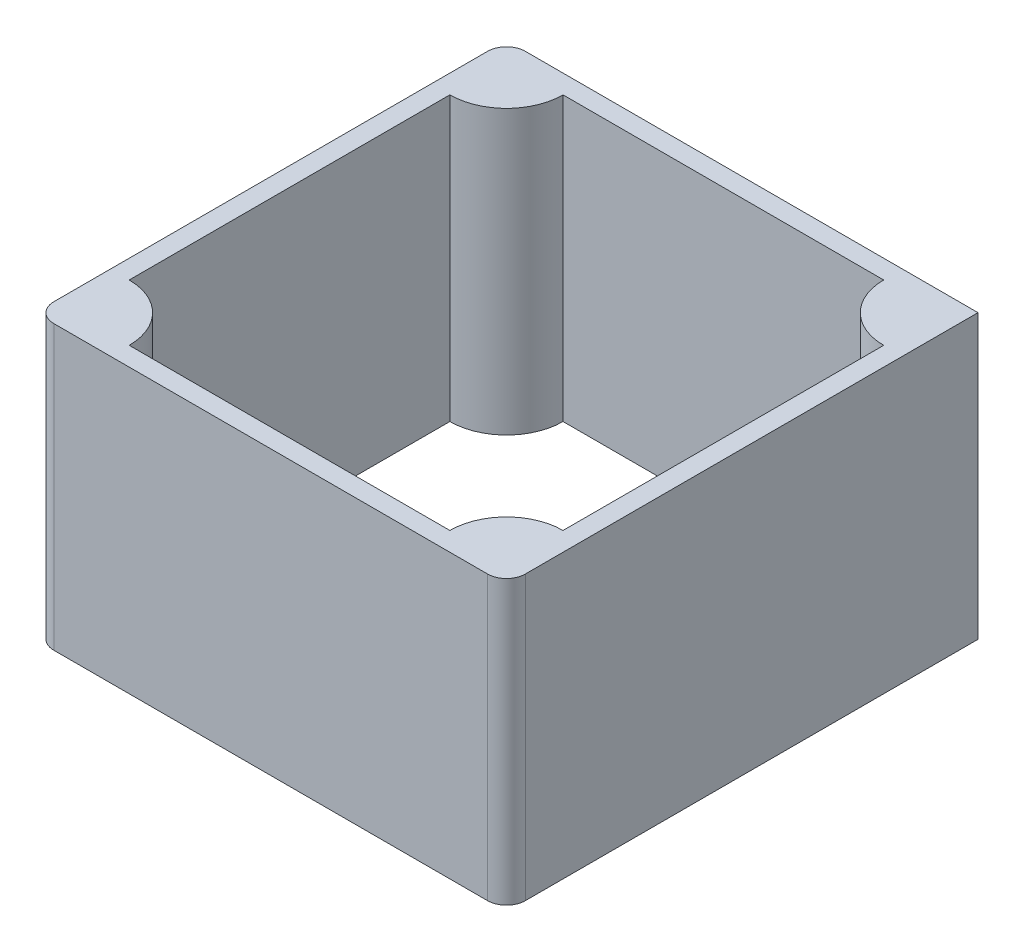
ISO-10303-21;
HEADER;
FILE_DESCRIPTION(('STEP AP214'),'2;1');
FILE_NAME('part.step','',(''),(''),'','','');
FILE_SCHEMA(('AUTOMOTIVE_DESIGN { 1 0 10303 214 1 1 1 1 }'));
ENDSEC;
DATA;
#1=APPLICATION_CONTEXT('core data for automotive mechanical design processes');
#2=APPLICATION_PROTOCOL_DEFINITION('international standard','automotive_design',2000,#1);
#3=PRODUCT_CONTEXT('',#1,'mechanical');
#4=PRODUCT('Part','Part','',(#3));
#5=PRODUCT_RELATED_PRODUCT_CATEGORY('part','',(#4));
#6=PRODUCT_DEFINITION_FORMATION('','',#4);
#7=PRODUCT_DEFINITION_CONTEXT('part definition',#1,'design');
#8=PRODUCT_DEFINITION('design','',#6,#7);
#9=PRODUCT_DEFINITION_SHAPE('','',#8);
#10=(LENGTH_UNIT() NAMED_UNIT(*) SI_UNIT(.MILLI.,.METRE.));
#11=(NAMED_UNIT(*) PLANE_ANGLE_UNIT() SI_UNIT($,.RADIAN.));
#12=(NAMED_UNIT(*) SI_UNIT($,.STERADIAN.) SOLID_ANGLE_UNIT());
#13=UNCERTAINTY_MEASURE_WITH_UNIT(LENGTH_MEASURE(1.E-05),#10,'distance_accuracy_value','');
#14=(GEOMETRIC_REPRESENTATION_CONTEXT(3) GLOBAL_UNCERTAINTY_ASSIGNED_CONTEXT((#13)) GLOBAL_UNIT_ASSIGNED_CONTEXT((#10,
#11,#12)) REPRESENTATION_CONTEXT('',''));
#15=CARTESIAN_POINT('',(0.,0.,0.));
#16=DIRECTION('',(0.,0.,1.));
#17=DIRECTION('',(1.,0.,0.));
#18=AXIS2_PLACEMENT_3D('',#15,#16,#17);
#19=CARTESIAN_POINT('',(0.,30.,0.));
#20=DIRECTION('',(0.,1.,0.));
#21=DIRECTION('',(0.,0.,1.));
#22=AXIS2_PLACEMENT_3D('',#19,#20,#21);
#23=PLANE('',#22);
#24=DIRECTION('',(-1.,0.,0.));
#25=VECTOR('',#24,1.);
#26=CARTESIAN_POINT('',(-11.2954846734203,30.,-9.66227881155136));
#27=LINE('',#26,#25);
#28=CARTESIAN_POINT('',(38.7045153265797,30.,-9.66227881155136));
#29=VERTEX_POINT('',#28);
#30=CARTESIAN_POINT('',(-9.29548467342035,30.,-9.66227881155136));
#31=VERTEX_POINT('',#30);
#32=EDGE_CURVE('E218',#29,#31,#27,.T.);
#33=ORIENTED_EDGE('',*,*,#32,.T.);
#34=CARTESIAN_POINT('',(-9.29548467342035,30.,-7.66227881155136));
#35=DIRECTION('',(0.,1.,0.));
#36=DIRECTION('',(0.,0.,1.));
#37=AXIS2_PLACEMENT_3D('',#34,#35,#36);
#38=CIRCLE('',#37,2.);
#39=CARTESIAN_POINT('',(-11.2954846734203,30.,-7.66227881155136));
#40=VERTEX_POINT('',#39);
#41=EDGE_CURVE('E248',#31,#40,#38,.T.);
#42=ORIENTED_EDGE('',*,*,#41,.T.);
#43=DIRECTION('',(0.,0.,1.));
#44=VECTOR('',#43,1.);
#45=CARTESIAN_POINT('',(-11.2954846734203,30.,-9.66227881155136));
#46=LINE('',#45,#44);
#47=CARTESIAN_POINT('',(-11.2954846734203,30.,38.3377211884486));
#48=VERTEX_POINT('',#47);
#49=EDGE_CURVE('E210',#40,#48,#46,.T.);
#50=ORIENTED_EDGE('',*,*,#49,.T.);
#51=CARTESIAN_POINT('',(-9.29548467342034,30.,38.3377211884486));
#52=DIRECTION('',(0.,1.,0.));
#53=DIRECTION('',(0.,0.,1.));
#54=AXIS2_PLACEMENT_3D('',#51,#52,#53);
#55=CIRCLE('',#54,2.);
#56=CARTESIAN_POINT('',(-9.29548467342034,30.,40.3377211884486));
#57=VERTEX_POINT('',#56);
#58=EDGE_CURVE('E245',#48,#57,#55,.T.);
#59=ORIENTED_EDGE('',*,*,#58,.T.);
#60=DIRECTION('',(1.,0.,0.));
#61=VECTOR('',#60,1.);
#62=CARTESIAN_POINT('',(-11.2954846734203,30.,40.3377211884486));
#63=LINE('',#62,#61);
#64=CARTESIAN_POINT('',(36.7045153265797,30.,40.3377211884486));
#65=VERTEX_POINT('',#64);
#66=EDGE_CURVE('E213',#57,#65,#63,.T.);
#67=ORIENTED_EDGE('',*,*,#66,.T.);
#68=CARTESIAN_POINT('',(36.7045153265797,30.,38.3377211884486));
#69=DIRECTION('',(0.,1.,0.));
#70=DIRECTION('',(0.,0.,1.));
#71=AXIS2_PLACEMENT_3D('',#68,#69,#70);
#72=CIRCLE('',#71,2.);
#73=CARTESIAN_POINT('',(38.7045153265797,30.,38.3377211884486));
#74=VERTEX_POINT('',#73);
#75=EDGE_CURVE('E47',#65,#74,#72,.T.);
#76=ORIENTED_EDGE('',*,*,#75,.T.);
#77=DIRECTION('',(0.,0.,-1.));
#78=VECTOR('',#77,1.);
#79=CARTESIAN_POINT('',(38.7045153265797,30.,-9.66227881155136));
#80=LINE('',#79,#78);
#81=EDGE_CURVE('E216',#74,#29,#80,.T.);
#82=ORIENTED_EDGE('',*,*,#81,.T.);
#83=EDGE_LOOP('',(#33,#42,#50,#59,#67,#76,#82));
#84=FACE_BOUND('',#83,.T.);
#85=DIRECTION('',(1.,0.,0.));
#86=VECTOR('',#85,1.);
#87=CARTESIAN_POINT('',(-3.29548467342032,30.,38.3377211884486));
#88=LINE('',#87,#86);
#89=CARTESIAN_POINT('',(-3.29548467342032,30.,38.3377211884486));
#90=VERTEX_POINT('',#89);
#91=CARTESIAN_POINT('',(30.7045153265796,30.,38.3377211884486));
#92=VERTEX_POINT('',#91);
#93=EDGE_CURVE('E150',#90,#92,#88,.T.);
#94=ORIENTED_EDGE('',*,*,#93,.F.);
#95=CARTESIAN_POINT('',(-9.29548467342034,30.,38.3377211884486));
#96=DIRECTION('',(0.,-1.,0.));
#97=DIRECTION('',(0.,0.,1.));
#98=AXIS2_PLACEMENT_3D('',#95,#96,#97);
#99=CIRCLE('',#98,6.00000000000002);
#100=CARTESIAN_POINT('',(-9.29548467342034,30.,32.3377211884486));
#101=VERTEX_POINT('',#100);
#102=EDGE_CURVE('E140',#101,#90,#99,.T.);
#103=ORIENTED_EDGE('',*,*,#102,.F.);
#104=DIRECTION('',(0.,0.,1.));
#105=VECTOR('',#104,1.);
#106=CARTESIAN_POINT('',(-9.29548467342036,30.,-1.66227881155136));
#107=LINE('',#106,#105);
#108=CARTESIAN_POINT('',(-9.29548467342036,30.,-1.66227881155136));
#109=VERTEX_POINT('',#108);
#110=EDGE_CURVE('E176',#109,#101,#107,.T.);
#111=ORIENTED_EDGE('',*,*,#110,.F.);
#112=CARTESIAN_POINT('',(-9.29548467342036,30.,-7.66227881155136));
#113=DIRECTION('',(0.,-1.,0.));
#114=DIRECTION('',(0.,0.,1.));
#115=AXIS2_PLACEMENT_3D('',#112,#113,#114);
#116=CIRCLE('',#115,6.);
#117=CARTESIAN_POINT('',(-3.29548467342036,30.,-7.66227881155136));
#118=VERTEX_POINT('',#117);
#119=EDGE_CURVE('E173',#118,#109,#116,.T.);
#120=ORIENTED_EDGE('',*,*,#119,.F.);
#121=DIRECTION('',(-1.,0.,0.));
#122=VECTOR('',#121,1.);
#123=CARTESIAN_POINT('',(-3.29548467342036,30.,-7.66227881155136));
#124=LINE('',#123,#122);
#125=CARTESIAN_POINT('',(30.7045153265796,30.,-7.66227881155137));
#126=VERTEX_POINT('',#125);
#127=EDGE_CURVE('E171',#126,#118,#124,.T.);
#128=ORIENTED_EDGE('',*,*,#127,.F.);
#129=CARTESIAN_POINT('',(36.7045153265796,30.,-7.66227881155137));
#130=DIRECTION('',(0.,-1.,0.));
#131=DIRECTION('',(0.,0.,1.));
#132=AXIS2_PLACEMENT_3D('',#129,#130,#131);
#133=CIRCLE('',#132,6.);
#134=CARTESIAN_POINT('',(36.7045153265796,30.,-1.66227881155137));
#135=VERTEX_POINT('',#134);
#136=EDGE_CURVE('E169',#135,#126,#133,.T.);
#137=ORIENTED_EDGE('',*,*,#136,.F.);
#138=DIRECTION('',(0.,0.,-1.));
#139=VECTOR('',#138,1.);
#140=CARTESIAN_POINT('',(36.7045153265796,30.,-1.66227881155137));
#141=LINE('',#140,#139);
#142=CARTESIAN_POINT('',(36.7045153265797,30.,32.3377211884486));
#143=VERTEX_POINT('',#142);
#144=EDGE_CURVE('E165',#143,#135,#141,.T.);
#145=ORIENTED_EDGE('',*,*,#144,.F.);
#146=CARTESIAN_POINT('',(36.7045153265797,30.,38.3377211884486));
#147=DIRECTION('',(0.,-1.,0.));
#148=DIRECTION('',(0.,0.,1.));
#149=AXIS2_PLACEMENT_3D('',#146,#147,#148);
#150=CIRCLE('',#149,6.00000000000002);
#151=EDGE_CURVE('E163',#92,#143,#150,.T.);
#152=ORIENTED_EDGE('',*,*,#151,.F.);
#153=EDGE_LOOP('',(#94,#103,#111,#120,#128,#137,#145,#152));
#154=FACE_BOUND('',#153,.T.);
#155=ADVANCED_FACE('F32',(#84,#154),#23,.T.);
#156=CARTESIAN_POINT('',(0.,0.,0.));
#157=DIRECTION('',(0.,1.,0.));
#158=DIRECTION('',(0.,0.,1.));
#159=AXIS2_PLACEMENT_3D('',#156,#157,#158);
#160=PLANE('',#159);
#161=DIRECTION('',(0.,0.,1.));
#162=VECTOR('',#161,1.);
#163=CARTESIAN_POINT('',(-11.2954846734203,0.,-9.66227881155136));
#164=LINE('',#163,#162);
#165=CARTESIAN_POINT('',(-11.2954846734203,0.,-7.66227881155136));
#166=VERTEX_POINT('',#165);
#167=CARTESIAN_POINT('',(-11.2954846734203,0.,38.3377211884486));
#168=VERTEX_POINT('',#167);
#169=EDGE_CURVE('E158',#166,#168,#164,.T.);
#170=ORIENTED_EDGE('',*,*,#169,.F.);
#171=CARTESIAN_POINT('',(-9.29548467342035,0.,-7.66227881155136));
#172=DIRECTION('',(0.,1.,0.));
#173=DIRECTION('',(0.,0.,1.));
#174=AXIS2_PLACEMENT_3D('',#171,#172,#173);
#175=CIRCLE('',#174,2.);
#176=CARTESIAN_POINT('',(-9.29548467342035,0.,-9.66227881155136));
#177=VERTEX_POINT('',#176);
#178=EDGE_CURVE('E241',#166,#177,#175,.F.);
#179=ORIENTED_EDGE('',*,*,#178,.T.);
#180=DIRECTION('',(-1.,0.,0.));
#181=VECTOR('',#180,1.);
#182=CARTESIAN_POINT('',(-11.2954846734203,0.,-9.66227881155136));
#183=LINE('',#182,#181);
#184=CARTESIAN_POINT('',(38.7045153265797,0.,-9.66227881155136));
#185=VERTEX_POINT('',#184);
#186=EDGE_CURVE('E214',#185,#177,#183,.T.);
#187=ORIENTED_EDGE('',*,*,#186,.F.);
#188=DIRECTION('',(0.,0.,-1.));
#189=VECTOR('',#188,1.);
#190=CARTESIAN_POINT('',(38.7045153265797,0.,-9.66227881155136));
#191=LINE('',#190,#189);
#192=CARTESIAN_POINT('',(38.7045153265797,0.,38.3377211884486));
#193=VERTEX_POINT('',#192);
#194=EDGE_CURVE('E226',#193,#185,#191,.T.);
#195=ORIENTED_EDGE('',*,*,#194,.F.);
#196=CARTESIAN_POINT('',(36.7045153265797,0.,38.3377211884486));
#197=DIRECTION('',(0.,1.,0.));
#198=DIRECTION('',(0.,0.,1.));
#199=AXIS2_PLACEMENT_3D('',#196,#197,#198);
#200=CIRCLE('',#199,2.);
#201=CARTESIAN_POINT('',(36.7045153265797,0.,40.3377211884486));
#202=VERTEX_POINT('',#201);
#203=EDGE_CURVE('E239',#193,#202,#200,.F.);
#204=ORIENTED_EDGE('',*,*,#203,.T.);
#205=DIRECTION('',(1.,0.,0.));
#206=VECTOR('',#205,1.);
#207=CARTESIAN_POINT('',(-11.2954846734203,0.,40.3377211884486));
#208=LINE('',#207,#206);
#209=CARTESIAN_POINT('',(-9.29548467342034,0.,40.3377211884486));
#210=VERTEX_POINT('',#209);
#211=EDGE_CURVE('E224',#210,#202,#208,.T.);
#212=ORIENTED_EDGE('',*,*,#211,.F.);
#213=CARTESIAN_POINT('',(-9.29548467342034,0.,38.3377211884486));
#214=DIRECTION('',(0.,1.,0.));
#215=DIRECTION('',(0.,0.,1.));
#216=AXIS2_PLACEMENT_3D('',#213,#214,#215);
#217=CIRCLE('',#216,2.);
#218=EDGE_CURVE('E237',#210,#168,#217,.F.);
#219=ORIENTED_EDGE('',*,*,#218,.T.);
#220=EDGE_LOOP('',(#170,#179,#187,#195,#204,#212,#219));
#221=FACE_BOUND('',#220,.T.);
#222=CARTESIAN_POINT('',(-9.29548467342034,0.,38.3377211884486));
#223=DIRECTION('',(0.,-1.,0.));
#224=DIRECTION('',(0.,0.,1.));
#225=AXIS2_PLACEMENT_3D('',#222,#223,#224);
#226=CIRCLE('',#225,6.00000000000002);
#227=CARTESIAN_POINT('',(-9.29548467342034,0.,32.3377211884486));
#228=VERTEX_POINT('',#227);
#229=CARTESIAN_POINT('',(-3.29548467342032,0.,38.3377211884486));
#230=VERTEX_POINT('',#229);
#231=EDGE_CURVE('E178',#228,#230,#226,.T.);
#232=ORIENTED_EDGE('',*,*,#231,.T.);
#233=DIRECTION('',(1.,0.,0.));
#234=VECTOR('',#233,1.);
#235=CARTESIAN_POINT('',(-3.29548467342032,0.,38.3377211884486));
#236=LINE('',#235,#234);
#237=CARTESIAN_POINT('',(30.7045153265796,0.,38.3377211884486));
#238=VERTEX_POINT('',#237);
#239=EDGE_CURVE('E157',#230,#238,#236,.T.);
#240=ORIENTED_EDGE('',*,*,#239,.T.);
#241=CARTESIAN_POINT('',(36.7045153265797,0.,38.3377211884486));
#242=DIRECTION('',(0.,-1.,0.));
#243=DIRECTION('',(0.,0.,1.));
#244=AXIS2_PLACEMENT_3D('',#241,#242,#243);
#245=CIRCLE('',#244,6.00000000000002);
#246=CARTESIAN_POINT('',(36.7045153265797,0.,32.3377211884486));
#247=VERTEX_POINT('',#246);
#248=EDGE_CURVE('E181',#238,#247,#245,.T.);
#249=ORIENTED_EDGE('',*,*,#248,.T.);
#250=DIRECTION('',(0.,0.,-1.));
#251=VECTOR('',#250,1.);
#252=CARTESIAN_POINT('',(36.7045153265796,0.,-1.66227881155137));
#253=LINE('',#252,#251);
#254=CARTESIAN_POINT('',(36.7045153265796,0.,-1.66227881155137));
#255=VERTEX_POINT('',#254);
#256=EDGE_CURVE('E184',#247,#255,#253,.T.);
#257=ORIENTED_EDGE('',*,*,#256,.T.);
#258=CARTESIAN_POINT('',(36.7045153265796,0.,-7.66227881155137));
#259=DIRECTION('',(0.,-1.,0.));
#260=DIRECTION('',(0.,0.,1.));
#261=AXIS2_PLACEMENT_3D('',#258,#259,#260);
#262=CIRCLE('',#261,6.);
#263=CARTESIAN_POINT('',(30.7045153265796,0.,-7.66227881155137));
#264=VERTEX_POINT('',#263);
#265=EDGE_CURVE('E187',#255,#264,#262,.T.);
#266=ORIENTED_EDGE('',*,*,#265,.T.);
#267=DIRECTION('',(-1.,0.,0.));
#268=VECTOR('',#267,1.);
#269=CARTESIAN_POINT('',(-3.29548467342036,0.,-7.66227881155136));
#270=LINE('',#269,#268);
#271=CARTESIAN_POINT('',(-3.29548467342036,0.,-7.66227881155136));
#272=VERTEX_POINT('',#271);
#273=EDGE_CURVE('E190',#264,#272,#270,.T.);
#274=ORIENTED_EDGE('',*,*,#273,.T.);
#275=CARTESIAN_POINT('',(-9.29548467342036,0.,-7.66227881155136));
#276=DIRECTION('',(0.,-1.,0.));
#277=DIRECTION('',(0.,0.,1.));
#278=AXIS2_PLACEMENT_3D('',#275,#276,#277);
#279=CIRCLE('',#278,6.);
#280=CARTESIAN_POINT('',(-9.29548467342036,0.,-1.66227881155136));
#281=VERTEX_POINT('',#280);
#282=EDGE_CURVE('E193',#272,#281,#279,.T.);
#283=ORIENTED_EDGE('',*,*,#282,.T.);
#284=DIRECTION('',(0.,0.,1.));
#285=VECTOR('',#284,1.);
#286=CARTESIAN_POINT('',(-9.29548467342036,0.,-1.66227881155136));
#287=LINE('',#286,#285);
#288=EDGE_CURVE('E151',#281,#228,#287,.T.);
#289=ORIENTED_EDGE('',*,*,#288,.T.);
#290=EDGE_LOOP('',(#232,#240,#249,#257,#266,#274,#283,#289));
#291=FACE_BOUND('',#290,.T.);
#292=ADVANCED_FACE('F260',(#221,#291),#160,.F.);
#293=CARTESIAN_POINT('',(-11.2954846734203,30.,-9.66227881155136));
#294=DIRECTION('',(1.,0.,0.));
#295=DIRECTION('',(0.,0.,-1.));
#296=AXIS2_PLACEMENT_3D('',#293,#294,#295);
#297=PLANE('',#296);
#298=ORIENTED_EDGE('',*,*,#49,.F.);
#299=DIRECTION('',(0.,-1.,0.));
#300=VECTOR('',#299,1.);
#301=CARTESIAN_POINT('',(-11.2954846734203,30.,-7.66227881155136));
#302=LINE('',#301,#300);
#303=EDGE_CURVE('E234',#40,#166,#302,.T.);
#304=ORIENTED_EDGE('',*,*,#303,.T.);
#305=ORIENTED_EDGE('',*,*,#169,.T.);
#306=DIRECTION('',(0.,-1.,0.));
#307=VECTOR('',#306,1.);
#308=CARTESIAN_POINT('',(-11.2954846734203,30.,38.3377211884486));
#309=LINE('',#308,#307);
#310=EDGE_CURVE('E232',#168,#48,#309,.F.);
#311=ORIENTED_EDGE('',*,*,#310,.T.);
#312=EDGE_LOOP('',(#298,#304,#305,#311));
#313=FACE_BOUND('',#312,.T.);
#314=ADVANCED_FACE('F279',(#313),#297,.F.);
#315=CARTESIAN_POINT('',(-11.2954846734203,30.,40.3377211884486));
#316=DIRECTION('',(0.,0.,-1.));
#317=DIRECTION('',(-1.,0.,0.));
#318=AXIS2_PLACEMENT_3D('',#315,#316,#317);
#319=PLANE('',#318);
#320=ORIENTED_EDGE('',*,*,#211,.T.);
#321=DIRECTION('',(0.,-1.,0.));
#322=VECTOR('',#321,1.);
#323=CARTESIAN_POINT('',(36.7045153265797,30.,40.3377211884486));
#324=LINE('',#323,#322);
#325=EDGE_CURVE('E11',#202,#65,#324,.F.);
#326=ORIENTED_EDGE('',*,*,#325,.T.);
#327=ORIENTED_EDGE('',*,*,#66,.F.);
#328=DIRECTION('',(0.,-1.,0.));
#329=VECTOR('',#328,1.);
#330=CARTESIAN_POINT('',(-9.29548467342034,30.,40.3377211884486));
#331=LINE('',#330,#329);
#332=EDGE_CURVE('E40',#57,#210,#331,.T.);
#333=ORIENTED_EDGE('',*,*,#332,.T.);
#334=EDGE_LOOP('',(#320,#326,#327,#333));
#335=FACE_BOUND('',#334,.T.);
#336=ADVANCED_FACE('F255',(#335),#319,.F.);
#337=CARTESIAN_POINT('',(38.7045153265797,30.,-9.66227881155136));
#338=DIRECTION('',(-1.,0.,0.));
#339=DIRECTION('',(0.,0.,1.));
#340=AXIS2_PLACEMENT_3D('',#337,#338,#339);
#341=PLANE('',#340);
#342=ORIENTED_EDGE('',*,*,#81,.F.);
#343=DIRECTION('',(0.,-1.,0.));
#344=VECTOR('',#343,1.);
#345=CARTESIAN_POINT('',(38.7045153265797,30.,38.3377211884486));
#346=LINE('',#345,#344);
#347=EDGE_CURVE('E250',#74,#193,#346,.T.);
#348=ORIENTED_EDGE('',*,*,#347,.T.);
#349=ORIENTED_EDGE('',*,*,#194,.T.);
#350=DIRECTION('',(0.,-1.,0.));
#351=VECTOR('',#350,1.);
#352=CARTESIAN_POINT('',(38.7045153265797,30.,-9.66227881155136));
#353=LINE('',#352,#351);
#354=EDGE_CURVE('E221',#29,#185,#353,.T.);
#355=ORIENTED_EDGE('',*,*,#354,.F.);
#356=EDGE_LOOP('',(#342,#348,#349,#355));
#357=FACE_BOUND('',#356,.T.);
#358=ADVANCED_FACE('F268',(#357),#341,.F.);
#359=CARTESIAN_POINT('',(-11.2954846734203,30.,-9.66227881155136));
#360=DIRECTION('',(0.,0.,1.));
#361=DIRECTION('',(1.,0.,0.));
#362=AXIS2_PLACEMENT_3D('',#359,#360,#361);
#363=PLANE('',#362);
#364=ORIENTED_EDGE('',*,*,#186,.T.);
#365=DIRECTION('',(0.,-1.,0.));
#366=VECTOR('',#365,1.);
#367=CARTESIAN_POINT('',(-9.29548467342035,30.,-9.66227881155136));
#368=LINE('',#367,#366);
#369=EDGE_CURVE('E243',#177,#31,#368,.F.);
#370=ORIENTED_EDGE('',*,*,#369,.T.);
#371=ORIENTED_EDGE('',*,*,#32,.F.);
#372=ORIENTED_EDGE('',*,*,#354,.T.);
#373=EDGE_LOOP('',(#364,#370,#371,#372));
#374=FACE_BOUND('',#373,.T.);
#375=ADVANCED_FACE('F281',(#374),#363,.F.);
#376=CARTESIAN_POINT('',(-9.29548467342034,30.,38.3377211884486));
#377=DIRECTION('',(0.,-1.,0.));
#378=DIRECTION('',(0.,0.,-1.));
#379=AXIS2_PLACEMENT_3D('',#376,#377,#378);
#380=CYLINDRICAL_SURFACE('',#379,6.00000000000002);
#381=ORIENTED_EDGE('',*,*,#231,.F.);
#382=DIRECTION('',(0.,-1.,0.));
#383=VECTOR('',#382,1.);
#384=CARTESIAN_POINT('',(-9.29548467342034,30.,32.3377211884486));
#385=LINE('',#384,#383);
#386=EDGE_CURVE('E146',#101,#228,#385,.T.);
#387=ORIENTED_EDGE('',*,*,#386,.F.);
#388=ORIENTED_EDGE('',*,*,#102,.T.);
#389=DIRECTION('',(0.,-1.,0.));
#390=VECTOR('',#389,1.);
#391=CARTESIAN_POINT('',(-3.29548467342032,30.,38.3377211884486));
#392=LINE('',#391,#390);
#393=EDGE_CURVE('E143',#90,#230,#392,.T.);
#394=ORIENTED_EDGE('',*,*,#393,.T.);
#395=EDGE_LOOP('',(#381,#387,#388,#394));
#396=FACE_BOUND('',#395,.T.);
#397=ADVANCED_FACE('F142',(#396),#380,.T.);
#398=CARTESIAN_POINT('',(-3.29548467342032,30.,38.3377211884486));
#399=DIRECTION('',(0.,0.,-1.));
#400=DIRECTION('',(-1.,0.,0.));
#401=AXIS2_PLACEMENT_3D('',#398,#399,#400);
#402=PLANE('',#401);
#403=ORIENTED_EDGE('',*,*,#239,.F.);
#404=ORIENTED_EDGE('',*,*,#393,.F.);
#405=ORIENTED_EDGE('',*,*,#93,.T.);
#406=DIRECTION('',(0.,-1.,0.));
#407=VECTOR('',#406,1.);
#408=CARTESIAN_POINT('',(30.7045153265796,30.,38.3377211884486));
#409=LINE('',#408,#407);
#410=EDGE_CURVE('E159',#92,#238,#409,.T.);
#411=ORIENTED_EDGE('',*,*,#410,.T.);
#412=EDGE_LOOP('',(#403,#404,#405,#411));
#413=FACE_BOUND('',#412,.T.);
#414=ADVANCED_FACE('F154',(#413),#402,.T.);
#415=CARTESIAN_POINT('',(36.7045153265797,30.,38.3377211884486));
#416=DIRECTION('',(0.,-1.,0.));
#417=DIRECTION('',(0.,0.,-1.));
#418=AXIS2_PLACEMENT_3D('',#415,#416,#417);
#419=CYLINDRICAL_SURFACE('',#418,6.00000000000002);
#420=ORIENTED_EDGE('',*,*,#248,.F.);
#421=ORIENTED_EDGE('',*,*,#410,.F.);
#422=ORIENTED_EDGE('',*,*,#151,.T.);
#423=DIRECTION('',(0.,-1.,0.));
#424=VECTOR('',#423,1.);
#425=CARTESIAN_POINT('',(36.7045153265797,30.,32.3377211884486));
#426=LINE('',#425,#424);
#427=EDGE_CURVE('E207',#143,#247,#426,.T.);
#428=ORIENTED_EDGE('',*,*,#427,.T.);
#429=EDGE_LOOP('',(#420,#421,#422,#428));
#430=FACE_BOUND('',#429,.T.);
#431=ADVANCED_FACE('F299',(#430),#419,.T.);
#432=CARTESIAN_POINT('',(36.7045153265796,30.,-1.66227881155137));
#433=DIRECTION('',(-1.,0.,0.));
#434=DIRECTION('',(0.,0.,1.));
#435=AXIS2_PLACEMENT_3D('',#432,#433,#434);
#436=PLANE('',#435);
#437=ORIENTED_EDGE('',*,*,#256,.F.);
#438=ORIENTED_EDGE('',*,*,#427,.F.);
#439=ORIENTED_EDGE('',*,*,#144,.T.);
#440=DIRECTION('',(0.,-1.,0.));
#441=VECTOR('',#440,1.);
#442=CARTESIAN_POINT('',(36.7045153265796,30.,-1.66227881155137));
#443=LINE('',#442,#441);
#444=EDGE_CURVE('E205',#135,#255,#443,.T.);
#445=ORIENTED_EDGE('',*,*,#444,.T.);
#446=EDGE_LOOP('',(#437,#438,#439,#445));
#447=FACE_BOUND('',#446,.T.);
#448=ADVANCED_FACE('F302',(#447),#436,.T.);
#449=CARTESIAN_POINT('',(36.7045153265796,30.,-7.66227881155137));
#450=DIRECTION('',(0.,-1.,0.));
#451=DIRECTION('',(0.,0.,-1.));
#452=AXIS2_PLACEMENT_3D('',#449,#450,#451);
#453=CYLINDRICAL_SURFACE('',#452,6.);
#454=ORIENTED_EDGE('',*,*,#265,.F.);
#455=ORIENTED_EDGE('',*,*,#444,.F.);
#456=ORIENTED_EDGE('',*,*,#136,.T.);
#457=DIRECTION('',(0.,-1.,0.));
#458=VECTOR('',#457,1.);
#459=CARTESIAN_POINT('',(30.7045153265796,30.,-7.66227881155137));
#460=LINE('',#459,#458);
#461=EDGE_CURVE('E203',#126,#264,#460,.T.);
#462=ORIENTED_EDGE('',*,*,#461,.T.);
#463=EDGE_LOOP('',(#454,#455,#456,#462));
#464=FACE_BOUND('',#463,.T.);
#465=ADVANCED_FACE('F306',(#464),#453,.T.);
#466=CARTESIAN_POINT('',(-3.29548467342036,30.,-7.66227881155136));
#467=DIRECTION('',(0.,0.,1.));
#468=DIRECTION('',(1.,0.,0.));
#469=AXIS2_PLACEMENT_3D('',#466,#467,#468);
#470=PLANE('',#469);
#471=ORIENTED_EDGE('',*,*,#273,.F.);
#472=ORIENTED_EDGE('',*,*,#461,.F.);
#473=ORIENTED_EDGE('',*,*,#127,.T.);
#474=DIRECTION('',(0.,-1.,0.));
#475=VECTOR('',#474,1.);
#476=CARTESIAN_POINT('',(-3.29548467342036,30.,-7.66227881155136));
#477=LINE('',#476,#475);
#478=EDGE_CURVE('E201',#118,#272,#477,.T.);
#479=ORIENTED_EDGE('',*,*,#478,.T.);
#480=EDGE_LOOP('',(#471,#472,#473,#479));
#481=FACE_BOUND('',#480,.T.);
#482=ADVANCED_FACE('F310',(#481),#470,.T.);
#483=CARTESIAN_POINT('',(-9.29548467342036,30.,-7.66227881155136));
#484=DIRECTION('',(0.,-1.,0.));
#485=DIRECTION('',(0.,0.,-1.));
#486=AXIS2_PLACEMENT_3D('',#483,#484,#485);
#487=CYLINDRICAL_SURFACE('',#486,6.);
#488=ORIENTED_EDGE('',*,*,#282,.F.);
#489=ORIENTED_EDGE('',*,*,#478,.F.);
#490=ORIENTED_EDGE('',*,*,#119,.T.);
#491=DIRECTION('',(0.,-1.,0.));
#492=VECTOR('',#491,1.);
#493=CARTESIAN_POINT('',(-9.29548467342036,30.,-1.66227881155136));
#494=LINE('',#493,#492);
#495=EDGE_CURVE('E199',#109,#281,#494,.T.);
#496=ORIENTED_EDGE('',*,*,#495,.T.);
#497=EDGE_LOOP('',(#488,#489,#490,#496));
#498=FACE_BOUND('',#497,.T.);
#499=ADVANCED_FACE('F314',(#498),#487,.T.);
#500=CARTESIAN_POINT('',(-9.29548467342036,30.,-1.66227881155136));
#501=DIRECTION('',(1.,0.,0.));
#502=DIRECTION('',(0.,0.,-1.));
#503=AXIS2_PLACEMENT_3D('',#500,#501,#502);
#504=PLANE('',#503);
#505=ORIENTED_EDGE('',*,*,#288,.F.);
#506=ORIENTED_EDGE('',*,*,#495,.F.);
#507=ORIENTED_EDGE('',*,*,#110,.T.);
#508=ORIENTED_EDGE('',*,*,#386,.T.);
#509=EDGE_LOOP('',(#505,#506,#507,#508));
#510=FACE_BOUND('',#509,.T.);
#511=ADVANCED_FACE('F318',(#510),#504,.T.);
#512=CARTESIAN_POINT('',(-9.29548467342035,30.,-7.66227881155136));
#513=DIRECTION('',(0.,-1.,0.));
#514=DIRECTION('',(0.,0.,-1.));
#515=AXIS2_PLACEMENT_3D('',#512,#513,#514);
#516=CYLINDRICAL_SURFACE('',#515,2.);
#517=ORIENTED_EDGE('',*,*,#41,.F.);
#518=ORIENTED_EDGE('',*,*,#369,.F.);
#519=ORIENTED_EDGE('',*,*,#178,.F.);
#520=ORIENTED_EDGE('',*,*,#303,.F.);
#521=EDGE_LOOP('',(#517,#518,#519,#520));
#522=FACE_BOUND('',#521,.T.);
#523=ADVANCED_FACE('F277',(#522),#516,.T.);
#524=CARTESIAN_POINT('',(36.7045153265797,30.,38.3377211884486));
#525=DIRECTION('',(0.,-1.,0.));
#526=DIRECTION('',(0.,0.,-1.));
#527=AXIS2_PLACEMENT_3D('',#524,#525,#526);
#528=CYLINDRICAL_SURFACE('',#527,2.);
#529=ORIENTED_EDGE('',*,*,#75,.F.);
#530=ORIENTED_EDGE('',*,*,#325,.F.);
#531=ORIENTED_EDGE('',*,*,#203,.F.);
#532=ORIENTED_EDGE('',*,*,#347,.F.);
#533=EDGE_LOOP('',(#529,#530,#531,#532));
#534=FACE_BOUND('',#533,.T.);
#535=ADVANCED_FACE('F266',(#534),#528,.T.);
#536=CARTESIAN_POINT('',(-9.29548467342034,30.,38.3377211884486));
#537=DIRECTION('',(0.,-1.,0.));
#538=DIRECTION('',(0.,0.,-1.));
#539=AXIS2_PLACEMENT_3D('',#536,#537,#538);
#540=CYLINDRICAL_SURFACE('',#539,2.);
#541=ORIENTED_EDGE('',*,*,#58,.F.);
#542=ORIENTED_EDGE('',*,*,#310,.F.);
#543=ORIENTED_EDGE('',*,*,#218,.F.);
#544=ORIENTED_EDGE('',*,*,#332,.F.);
#545=EDGE_LOOP('',(#541,#542,#543,#544));
#546=FACE_BOUND('',#545,.T.);
#547=ADVANCED_FACE('F34',(#546),#540,.T.);
#548=CLOSED_SHELL('',(#155,#292,#314,#336,#358,#375,#397,#414,#431,#448,#465,#482,#499,#511,
#523,#535,#547));
#549=MANIFOLD_SOLID_BREP('B2',#548);
#550=ADVANCED_BREP_SHAPE_REPRESENTATION('',(#18,#549),#14);
#551=SHAPE_DEFINITION_REPRESENTATION(#9,#550);
ENDSEC;
END-ISO-10303-21;
